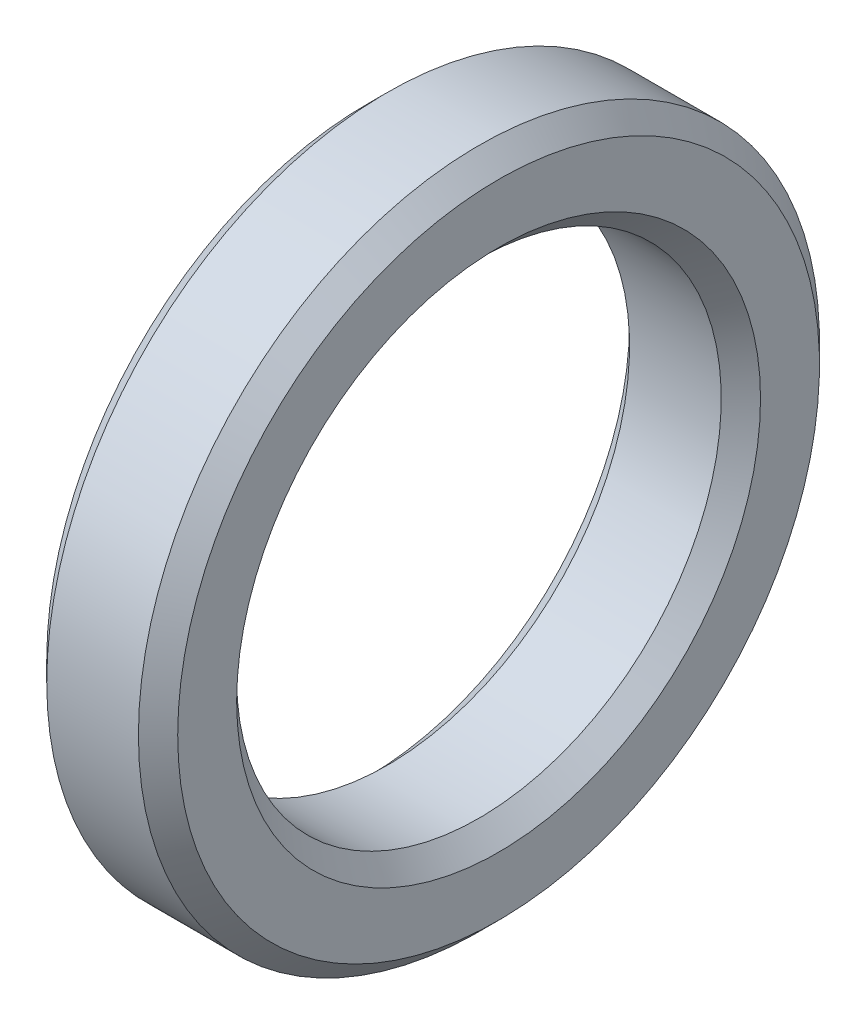
ISO-10303-21;
HEADER;
FILE_DESCRIPTION(('STEP AP214'),'2;1');
FILE_NAME('part.step','',(''),(''),'','','');
FILE_SCHEMA(('AUTOMOTIVE_DESIGN { 1 0 10303 214 1 1 1 1 }'));
ENDSEC;
DATA;
#1=APPLICATION_CONTEXT('core data for automotive mechanical design processes');
#2=APPLICATION_PROTOCOL_DEFINITION('international standard','automotive_design',2000,#1);
#3=PRODUCT_CONTEXT('',#1,'mechanical');
#4=PRODUCT('Part','Part','',(#3));
#5=PRODUCT_RELATED_PRODUCT_CATEGORY('part','',(#4));
#6=PRODUCT_DEFINITION_FORMATION('','',#4);
#7=PRODUCT_DEFINITION_CONTEXT('part definition',#1,'design');
#8=PRODUCT_DEFINITION('design','',#6,#7);
#9=PRODUCT_DEFINITION_SHAPE('','',#8);
#10=(LENGTH_UNIT() NAMED_UNIT(*) SI_UNIT(.MILLI.,.METRE.));
#11=(NAMED_UNIT(*) PLANE_ANGLE_UNIT() SI_UNIT($,.RADIAN.));
#12=(NAMED_UNIT(*) SI_UNIT($,.STERADIAN.) SOLID_ANGLE_UNIT());
#13=UNCERTAINTY_MEASURE_WITH_UNIT(LENGTH_MEASURE(1.E-05),#10,'distance_accuracy_value','');
#14=(GEOMETRIC_REPRESENTATION_CONTEXT(3) GLOBAL_UNCERTAINTY_ASSIGNED_CONTEXT((#13)) GLOBAL_UNIT_ASSIGNED_CONTEXT((#10,
#11,#12)) REPRESENTATION_CONTEXT('',''));
#15=CARTESIAN_POINT('',(0.,0.,0.));
#16=DIRECTION('',(0.,0.,1.));
#17=DIRECTION('',(1.,0.,0.));
#18=AXIS2_PLACEMENT_3D('',#15,#16,#17);
#19=CARTESIAN_POINT('',(0.,24.5,0.));
#20=DIRECTION('',(1.,0.,0.));
#21=DIRECTION('',(0.,0.,-1.));
#22=AXIS2_PLACEMENT_3D('',#19,#20,#21);
#23=PLANE('',#22);
#24=CARTESIAN_POINT('',(0.,0.,0.));
#25=DIRECTION('',(-1.,0.,0.));
#26=DIRECTION('',(0.,0.,1.));
#27=AXIS2_PLACEMENT_3D('',#24,#25,#26);
#28=CIRCLE('',#27,24.5);
#29=CARTESIAN_POINT('',(0.,0.,24.5));
#30=VERTEX_POINT('',#29);
#31=EDGE_CURVE('E130',#30,#30,#28,.T.);
#32=ORIENTED_EDGE('',*,*,#31,.T.);
#33=EDGE_LOOP('',(#32));
#34=FACE_BOUND('',#33,.T.);
#35=CARTESIAN_POINT('',(0.,0.,0.));
#36=DIRECTION('',(-1.,0.,0.));
#37=DIRECTION('',(0.,0.,1.));
#38=AXIS2_PLACEMENT_3D('',#35,#36,#37);
#39=CIRCLE('',#38,20.);
#40=CARTESIAN_POINT('',(0.,20.,0.));
#41=VERTEX_POINT('',#40);
#42=CARTESIAN_POINT('',(0.,0.,-20.));
#43=VERTEX_POINT('',#42);
#44=EDGE_CURVE('E125',#41,#43,#39,.T.);
#45=ORIENTED_EDGE('',*,*,#44,.F.);
#46=CARTESIAN_POINT('',(0.,22.,0.));
#47=DIRECTION('',(-1.,0.,0.));
#48=DIRECTION('',(0.,0.,1.));
#49=AXIS2_PLACEMENT_3D('',#46,#47,#48);
#50=CIRCLE('',#49,1.99999999999999);
#51=EDGE_CURVE('E65',#41,#41,#50,.T.);
#52=ORIENTED_EDGE('',*,*,#51,.F.);
#53=CARTESIAN_POINT('',(0.,0.,20.));
#54=VERTEX_POINT('',#53);
#55=EDGE_CURVE('E339',#54,#41,#39,.T.);
#56=ORIENTED_EDGE('',*,*,#55,.F.);
#57=CARTESIAN_POINT('',(0.,0.,22.));
#58=DIRECTION('',(-1.,0.,0.));
#59=DIRECTION('',(0.,0.,1.));
#60=AXIS2_PLACEMENT_3D('',#57,#58,#59);
#61=CIRCLE('',#60,1.99999999999999);
#62=EDGE_CURVE('E70',#54,#54,#61,.T.);
#63=ORIENTED_EDGE('',*,*,#62,.F.);
#64=CARTESIAN_POINT('',(0.,-20.,0.));
#65=VERTEX_POINT('',#64);
#66=EDGE_CURVE('E131',#65,#54,#39,.T.);
#67=ORIENTED_EDGE('',*,*,#66,.F.);
#68=CARTESIAN_POINT('',(0.,-22.,0.));
#69=DIRECTION('',(-1.,0.,0.));
#70=DIRECTION('',(0.,0.,1.));
#71=AXIS2_PLACEMENT_3D('',#68,#69,#70);
#72=CIRCLE('',#71,1.99999999999999);
#73=EDGE_CURVE('E110',#65,#65,#72,.T.);
#74=ORIENTED_EDGE('',*,*,#73,.F.);
#75=EDGE_CURVE('E126',#43,#65,#39,.T.);
#76=ORIENTED_EDGE('',*,*,#75,.F.);
#77=CARTESIAN_POINT('',(0.,0.,-22.));
#78=DIRECTION('',(-1.,0.,0.));
#79=DIRECTION('',(0.,0.,1.));
#80=AXIS2_PLACEMENT_3D('',#77,#78,#79);
#81=CIRCLE('',#80,1.99999999999999);
#82=EDGE_CURVE('E117',#43,#43,#81,.T.);
#83=ORIENTED_EDGE('',*,*,#82,.F.);
#84=EDGE_LOOP('',(#45,#52,#56,#63,#67,#74,#76,#83));
#85=FACE_BOUND('',#84,.T.);
#86=ADVANCED_FACE('F51',(#34,#85),#23,.F.);
#87=CARTESIAN_POINT('',(0.,0.,0.));
#88=DIRECTION('',(-1.,0.,0.));
#89=DIRECTION('',(0.,0.,1.));
#90=AXIS2_PLACEMENT_3D('',#87,#88,#89);
#91=CONICAL_SURFACE('',#90,20.,0.785398163397449);
#92=CARTESIAN_POINT('',(1.5,0.,0.));
#93=DIRECTION('',(-1.,0.,0.));
#94=DIRECTION('',(0.,0.,1.));
#95=AXIS2_PLACEMENT_3D('',#92,#93,#94);
#96=CIRCLE('',#95,18.5);
#97=CARTESIAN_POINT('',(1.5,0.,18.5));
#98=VERTEX_POINT('',#97);
#99=EDGE_CURVE('E11',#98,#98,#96,.T.);
#100=ORIENTED_EDGE('',*,*,#99,.F.);
#101=EDGE_LOOP('',(#100));
#102=FACE_BOUND('',#101,.T.);
#103=ORIENTED_EDGE('',*,*,#75,.T.);
#104=ORIENTED_EDGE('',*,*,#66,.T.);
#105=ORIENTED_EDGE('',*,*,#55,.T.);
#106=ORIENTED_EDGE('',*,*,#44,.T.);
#107=EDGE_LOOP('',(#103,#104,#105,#106));
#108=FACE_BOUND('',#107,.T.);
#109=ADVANCED_FACE('F53',(#102,#108),#91,.F.);
#110=CARTESIAN_POINT('',(0.,0.,0.));
#111=DIRECTION('',(-1.,0.,0.));
#112=DIRECTION('',(0.,0.,1.));
#113=AXIS2_PLACEMENT_3D('',#110,#111,#112);
#114=CYLINDRICAL_SURFACE('',#113,18.5);
#115=CARTESIAN_POINT('',(8.5,0.,0.));
#116=DIRECTION('',(-1.,0.,0.));
#117=DIRECTION('',(0.,0.,1.));
#118=AXIS2_PLACEMENT_3D('',#115,#116,#117);
#119=CIRCLE('',#118,18.5);
#120=CARTESIAN_POINT('',(8.5,0.,18.5));
#121=VERTEX_POINT('',#120);
#122=EDGE_CURVE('E60',#121,#121,#119,.T.);
#123=ORIENTED_EDGE('',*,*,#122,.F.);
#124=EDGE_LOOP('',(#123));
#125=FACE_BOUND('',#124,.T.);
#126=ORIENTED_EDGE('',*,*,#99,.T.);
#127=EDGE_LOOP('',(#126));
#128=FACE_BOUND('',#127,.T.);
#129=ADVANCED_FACE('F156',(#125,#128),#114,.F.);
#130=CARTESIAN_POINT('',(8.5,0.,0.));
#131=DIRECTION('',(1.,0.,0.));
#132=DIRECTION('',(0.,0.,-1.));
#133=AXIS2_PLACEMENT_3D('',#130,#131,#132);
#134=CONICAL_SURFACE('',#133,18.5,0.785398163397449);
#135=CARTESIAN_POINT('',(10.,0.,0.));
#136=DIRECTION('',(-1.,0.,0.));
#137=DIRECTION('',(0.,0.,1.));
#138=AXIS2_PLACEMENT_3D('',#135,#136,#137);
#139=CIRCLE('',#138,20.);
#140=CARTESIAN_POINT('',(10.,0.,20.));
#141=VERTEX_POINT('',#140);
#142=EDGE_CURVE('E147',#141,#141,#139,.T.);
#143=ORIENTED_EDGE('',*,*,#142,.F.);
#144=EDGE_LOOP('',(#143));
#145=FACE_BOUND('',#144,.T.);
#146=ORIENTED_EDGE('',*,*,#122,.T.);
#147=EDGE_LOOP('',(#146));
#148=FACE_BOUND('',#147,.T.);
#149=ADVANCED_FACE('F154',(#145,#148),#134,.F.);
#150=CARTESIAN_POINT('',(10.,20.,0.));
#151=DIRECTION('',(-1.,0.,0.));
#152=DIRECTION('',(0.,0.,1.));
#153=AXIS2_PLACEMENT_3D('',#150,#151,#152);
#154=PLANE('',#153);
#155=CARTESIAN_POINT('',(10.,0.,0.));
#156=DIRECTION('',(-1.,0.,0.));
#157=DIRECTION('',(0.,0.,1.));
#158=AXIS2_PLACEMENT_3D('',#155,#156,#157);
#159=CIRCLE('',#158,24.5);
#160=CARTESIAN_POINT('',(10.,0.,24.5));
#161=VERTEX_POINT('',#160);
#162=EDGE_CURVE('E143',#161,#161,#159,.T.);
#163=ORIENTED_EDGE('',*,*,#162,.F.);
#164=EDGE_LOOP('',(#163));
#165=FACE_BOUND('',#164,.T.);
#166=ORIENTED_EDGE('',*,*,#142,.T.);
#167=EDGE_LOOP('',(#166));
#168=FACE_BOUND('',#167,.T.);
#169=ADVANCED_FACE('F208',(#165,#168),#154,.F.);
#170=CARTESIAN_POINT('',(10.,0.,0.));
#171=DIRECTION('',(-1.,0.,0.));
#172=DIRECTION('',(0.,0.,1.));
#173=AXIS2_PLACEMENT_3D('',#170,#171,#172);
#174=CONICAL_SURFACE('',#173,24.5,0.785398163397449);
#175=CARTESIAN_POINT('',(8.5,0.,0.));
#176=DIRECTION('',(-1.,0.,0.));
#177=DIRECTION('',(0.,0.,1.));
#178=AXIS2_PLACEMENT_3D('',#175,#176,#177);
#179=CIRCLE('',#178,26.);
#180=CARTESIAN_POINT('',(8.5,0.,26.));
#181=VERTEX_POINT('',#180);
#182=EDGE_CURVE('E139',#181,#181,#179,.T.);
#183=ORIENTED_EDGE('',*,*,#182,.F.);
#184=EDGE_LOOP('',(#183));
#185=FACE_BOUND('',#184,.T.);
#186=ORIENTED_EDGE('',*,*,#162,.T.);
#187=EDGE_LOOP('',(#186));
#188=FACE_BOUND('',#187,.T.);
#189=ADVANCED_FACE('F204',(#185,#188),#174,.T.);
#190=CARTESIAN_POINT('',(0.,0.,0.));
#191=DIRECTION('',(-1.,0.,0.));
#192=DIRECTION('',(0.,0.,1.));
#193=AXIS2_PLACEMENT_3D('',#190,#191,#192);
#194=CYLINDRICAL_SURFACE('',#193,26.);
#195=CARTESIAN_POINT('',(1.5,0.,0.));
#196=DIRECTION('',(-1.,0.,0.));
#197=DIRECTION('',(0.,0.,1.));
#198=AXIS2_PLACEMENT_3D('',#195,#196,#197);
#199=CIRCLE('',#198,26.);
#200=CARTESIAN_POINT('',(1.5,0.,26.));
#201=VERTEX_POINT('',#200);
#202=EDGE_CURVE('E135',#201,#201,#199,.T.);
#203=ORIENTED_EDGE('',*,*,#202,.F.);
#204=EDGE_LOOP('',(#203));
#205=FACE_BOUND('',#204,.T.);
#206=ORIENTED_EDGE('',*,*,#182,.T.);
#207=EDGE_LOOP('',(#206));
#208=FACE_BOUND('',#207,.T.);
#209=ADVANCED_FACE('F200',(#205,#208),#194,.T.);
#210=CARTESIAN_POINT('',(1.5,0.,0.));
#211=DIRECTION('',(1.,0.,0.));
#212=DIRECTION('',(0.,0.,-1.));
#213=AXIS2_PLACEMENT_3D('',#210,#211,#212);
#214=CONICAL_SURFACE('',#213,26.,0.785398163397449);
#215=ORIENTED_EDGE('',*,*,#31,.F.);
#216=EDGE_LOOP('',(#215));
#217=FACE_BOUND('',#216,.T.);
#218=ORIENTED_EDGE('',*,*,#202,.T.);
#219=EDGE_LOOP('',(#218));
#220=FACE_BOUND('',#219,.T.);
#221=ADVANCED_FACE('F198',(#217,#220),#214,.T.);
#222=CARTESIAN_POINT('',(5.,0.,-22.));
#223=DIRECTION('',(-1.,0.,0.));
#224=DIRECTION('',(0.,0.,1.));
#225=AXIS2_PLACEMENT_3D('',#222,#223,#224);
#226=CONICAL_SURFACE('',#225,2.,1.02974425867665);
#227=CARTESIAN_POINT('',(6.20172123805512,0.,-22.));
#228=VERTEX_POINT('',#227);
#229=VERTEX_LOOP('',#228);
#230=FACE_BOUND('',#229,.T.);
#231=CARTESIAN_POINT('',(5.,0.,-22.));
#232=DIRECTION('',(-1.,0.,0.));
#233=DIRECTION('',(0.,0.,1.));
#234=AXIS2_PLACEMENT_3D('',#231,#232,#233);
#235=CIRCLE('',#234,2.);
#236=CARTESIAN_POINT('',(5.,0.,-20.));
#237=VERTEX_POINT('',#236);
#238=EDGE_CURVE('E121',#237,#237,#235,.T.);
#239=ORIENTED_EDGE('',*,*,#238,.T.);
#240=EDGE_LOOP('',(#239));
#241=FACE_BOUND('',#240,.T.);
#242=ADVANCED_FACE('F196',(#230,#241),#226,.F.);
#243=CARTESIAN_POINT('',(0.,0.,-22.));
#244=DIRECTION('',(-1.,0.,0.));
#245=DIRECTION('',(0.,0.,1.));
#246=AXIS2_PLACEMENT_3D('',#243,#244,#245);
#247=CYLINDRICAL_SURFACE('',#246,1.99999999999999);
#248=ORIENTED_EDGE('',*,*,#238,.F.);
#249=EDGE_LOOP('',(#248));
#250=FACE_BOUND('',#249,.T.);
#251=ORIENTED_EDGE('',*,*,#82,.T.);
#252=EDGE_LOOP('',(#251));
#253=FACE_BOUND('',#252,.T.);
#254=ADVANCED_FACE('F184',(#250,#253),#247,.F.);
#255=CARTESIAN_POINT('',(5.,-22.,0.));
#256=DIRECTION('',(-1.,0.,0.));
#257=DIRECTION('',(0.,0.,1.));
#258=AXIS2_PLACEMENT_3D('',#255,#256,#257);
#259=CONICAL_SURFACE('',#258,1.99999999999999,1.02974425867665);
#260=CARTESIAN_POINT('',(6.20172123805512,-22.,0.));
#261=VERTEX_POINT('',#260);
#262=VERTEX_LOOP('',#261);
#263=FACE_BOUND('',#262,.T.);
#264=CARTESIAN_POINT('',(5.,-22.,0.));
#265=DIRECTION('',(-1.,0.,0.));
#266=DIRECTION('',(0.,0.,1.));
#267=AXIS2_PLACEMENT_3D('',#264,#265,#266);
#268=CIRCLE('',#267,1.99999999999999);
#269=CARTESIAN_POINT('',(5.,-22.,1.99999999999999));
#270=VERTEX_POINT('',#269);
#271=EDGE_CURVE('E113',#270,#270,#268,.T.);
#272=ORIENTED_EDGE('',*,*,#271,.T.);
#273=EDGE_LOOP('',(#272));
#274=FACE_BOUND('',#273,.T.);
#275=ADVANCED_FACE('F175',(#263,#274),#259,.F.);
#276=CARTESIAN_POINT('',(0.,-22.,0.));
#277=DIRECTION('',(-1.,0.,0.));
#278=DIRECTION('',(0.,0.,1.));
#279=AXIS2_PLACEMENT_3D('',#276,#277,#278);
#280=CYLINDRICAL_SURFACE('',#279,1.99999999999999);
#281=ORIENTED_EDGE('',*,*,#271,.F.);
#282=EDGE_LOOP('',(#281));
#283=FACE_BOUND('',#282,.T.);
#284=ORIENTED_EDGE('',*,*,#73,.T.);
#285=EDGE_LOOP('',(#284));
#286=FACE_BOUND('',#285,.T.);
#287=ADVANCED_FACE('F172',(#283,#286),#280,.F.);
#288=CARTESIAN_POINT('',(5.,0.,22.));
#289=DIRECTION('',(-1.,0.,0.));
#290=DIRECTION('',(0.,0.,1.));
#291=AXIS2_PLACEMENT_3D('',#288,#289,#290);
#292=CONICAL_SURFACE('',#291,2.,1.02974425867665);
#293=CARTESIAN_POINT('',(6.20172123805512,0.,22.));
#294=VERTEX_POINT('',#293);
#295=VERTEX_LOOP('',#294);
#296=FACE_BOUND('',#295,.T.);
#297=CARTESIAN_POINT('',(5.,0.,22.));
#298=DIRECTION('',(-1.,0.,0.));
#299=DIRECTION('',(0.,0.,1.));
#300=AXIS2_PLACEMENT_3D('',#297,#298,#299);
#301=CIRCLE('',#300,2.);
#302=CARTESIAN_POINT('',(5.,0.,24.));
#303=VERTEX_POINT('',#302);
#304=EDGE_CURVE('E103',#303,#303,#301,.T.);
#305=ORIENTED_EDGE('',*,*,#304,.T.);
#306=EDGE_LOOP('',(#305));
#307=FACE_BOUND('',#306,.T.);
#308=ADVANCED_FACE('F174',(#296,#307),#292,.F.);
#309=CARTESIAN_POINT('',(0.,0.,22.));
#310=DIRECTION('',(-1.,0.,0.));
#311=DIRECTION('',(0.,0.,1.));
#312=AXIS2_PLACEMENT_3D('',#309,#310,#311);
#313=CYLINDRICAL_SURFACE('',#312,1.99999999999999);
#314=ORIENTED_EDGE('',*,*,#304,.F.);
#315=EDGE_LOOP('',(#314));
#316=FACE_BOUND('',#315,.T.);
#317=ORIENTED_EDGE('',*,*,#62,.T.);
#318=EDGE_LOOP('',(#317));
#319=FACE_BOUND('',#318,.T.);
#320=ADVANCED_FACE('F93',(#316,#319),#313,.F.);
#321=CARTESIAN_POINT('',(5.,22.,0.));
#322=DIRECTION('',(-1.,0.,0.));
#323=DIRECTION('',(0.,0.,1.));
#324=AXIS2_PLACEMENT_3D('',#321,#322,#323);
#325=CONICAL_SURFACE('',#324,1.99999999999999,1.02974425867665);
#326=CARTESIAN_POINT('',(6.20172123805512,22.,0.));
#327=VERTEX_POINT('',#326);
#328=VERTEX_LOOP('',#327);
#329=FACE_BOUND('',#328,.T.);
#330=CARTESIAN_POINT('',(5.,22.,0.));
#331=DIRECTION('',(-1.,0.,0.));
#332=DIRECTION('',(0.,0.,1.));
#333=AXIS2_PLACEMENT_3D('',#330,#331,#332);
#334=CIRCLE('',#333,1.99999999999999);
#335=CARTESIAN_POINT('',(5.,22.,1.99999999999999));
#336=VERTEX_POINT('',#335);
#337=EDGE_CURVE('E97',#336,#336,#334,.T.);
#338=ORIENTED_EDGE('',*,*,#337,.T.);
#339=EDGE_LOOP('',(#338));
#340=FACE_BOUND('',#339,.T.);
#341=ADVANCED_FACE('F89',(#329,#340),#325,.F.);
#342=CARTESIAN_POINT('',(0.,22.,0.));
#343=DIRECTION('',(-1.,0.,0.));
#344=DIRECTION('',(0.,0.,1.));
#345=AXIS2_PLACEMENT_3D('',#342,#343,#344);
#346=CYLINDRICAL_SURFACE('',#345,1.99999999999999);
#347=ORIENTED_EDGE('',*,*,#337,.F.);
#348=EDGE_LOOP('',(#347));
#349=FACE_BOUND('',#348,.T.);
#350=ORIENTED_EDGE('',*,*,#51,.T.);
#351=EDGE_LOOP('',(#350));
#352=FACE_BOUND('',#351,.T.);
#353=ADVANCED_FACE('F92',(#349,#352),#346,.F.);
#354=CLOSED_SHELL('',(#86,#109,#129,#149,#169,#189,#209,#221,#242,#254,#275,#287,#308,#320,#341,#353));
#355=MANIFOLD_SOLID_BREP('B2',#354);
#356=ADVANCED_BREP_SHAPE_REPRESENTATION('',(#18,#355),#14);
#357=SHAPE_DEFINITION_REPRESENTATION(#9,#356);
ENDSEC;
END-ISO-10303-21;
